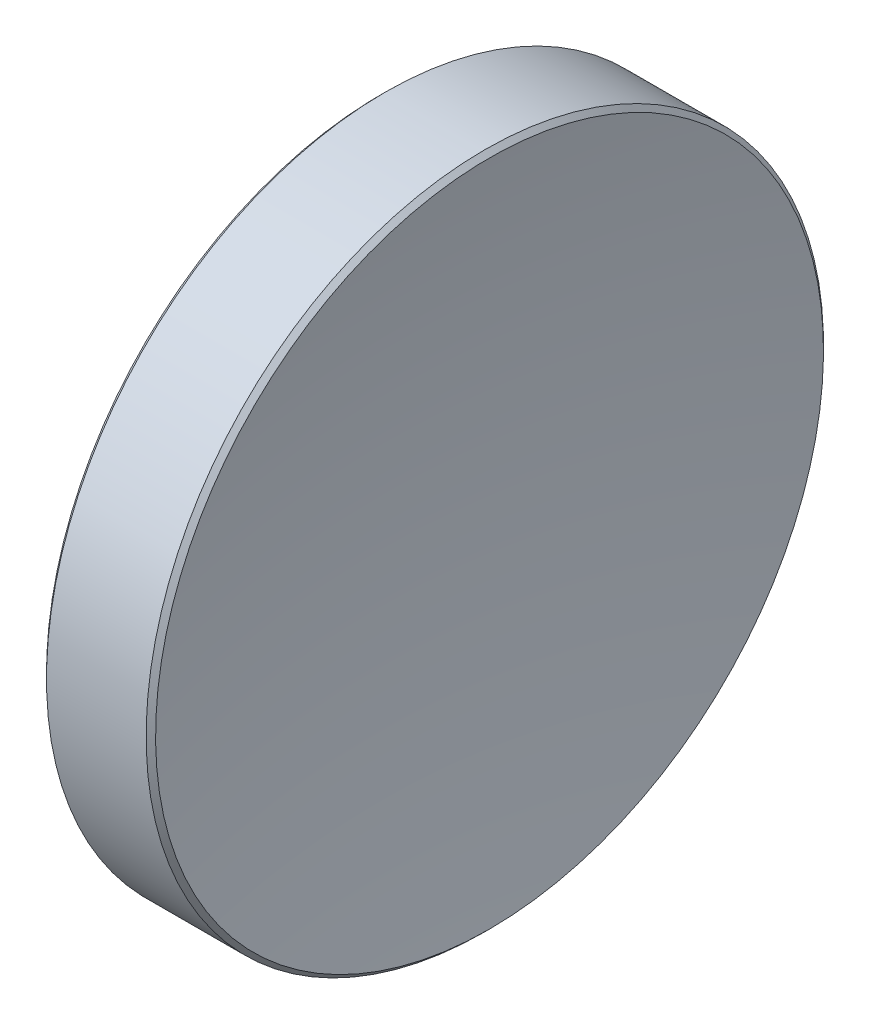
ISO-10303-21;
HEADER;
FILE_DESCRIPTION(('STEP AP214'),'2;1');
FILE_NAME('part.step','',(''),(''),'','','');
FILE_SCHEMA(('AUTOMOTIVE_DESIGN { 1 0 10303 214 1 1 1 1 }'));
ENDSEC;
DATA;
#1=APPLICATION_CONTEXT('core data for automotive mechanical design processes');
#2=APPLICATION_PROTOCOL_DEFINITION('international standard','automotive_design',2000,#1);
#3=PRODUCT_CONTEXT('',#1,'mechanical');
#4=PRODUCT('Part','Part','',(#3));
#5=PRODUCT_RELATED_PRODUCT_CATEGORY('part','',(#4));
#6=PRODUCT_DEFINITION_FORMATION('','',#4);
#7=PRODUCT_DEFINITION_CONTEXT('part definition',#1,'design');
#8=PRODUCT_DEFINITION('design','',#6,#7);
#9=PRODUCT_DEFINITION_SHAPE('','',#8);
#10=(LENGTH_UNIT() NAMED_UNIT(*) SI_UNIT(.MILLI.,.METRE.));
#11=(NAMED_UNIT(*) PLANE_ANGLE_UNIT() SI_UNIT($,.RADIAN.));
#12=(NAMED_UNIT(*) SI_UNIT($,.STERADIAN.) SOLID_ANGLE_UNIT());
#13=UNCERTAINTY_MEASURE_WITH_UNIT(LENGTH_MEASURE(1.E-05),#10,'distance_accuracy_value','');
#14=(GEOMETRIC_REPRESENTATION_CONTEXT(3) GLOBAL_UNCERTAINTY_ASSIGNED_CONTEXT((#13)) GLOBAL_UNIT_ASSIGNED_CONTEXT((#10,
#11,#12)) REPRESENTATION_CONTEXT('',''));
#15=CARTESIAN_POINT('',(0.,0.,0.));
#16=DIRECTION('',(0.,0.,1.));
#17=DIRECTION('',(1.,0.,0.));
#18=AXIS2_PLACEMENT_3D('',#15,#16,#17);
#19=CARTESIAN_POINT('',(148.249977726173,-0.0817444038738536,0.));
#20=DIRECTION('',(0.,0.,-1.));
#21=DIRECTION('',(0.,-1.,0.));
#22=AXIS2_PLACEMENT_3D('',#19,#20,#21);
#23=CIRCLE('',#22,150.);
#24=TRIMMED_CURVE('',#23,(PARAMETER_VALUE(-1.57134128951436)),
(PARAMETER_VALUE(1.57134128951436)),.T.,.PARAMETER.);
#25=CARTESIAN_POINT('',(148.249977726173,0.,0.));
#26=DIRECTION('',(-1.,0.,0.));
#27=AXIS1_PLACEMENT('',#25,#26);
#28=SURFACE_OF_REVOLUTION('',#24,#27);
#29=CARTESIAN_POINT('',(-1.75,0.,0.));
#30=VERTEX_POINT('',#29);
#31=VERTEX_LOOP('',#30);
#32=FACE_BOUND('',#31,.T.);
#33=CARTESIAN_POINT('',(-1.23316380744669,0.,0.));
#34=DIRECTION('',(-1.,0.,0.));
#35=DIRECTION('',(0.,-1.,0.));
#36=AXIS2_PLACEMENT_3D('',#33,#34,#35);
#37=CIRCLE('',#36,12.5232233047034);
#38=CARTESIAN_POINT('',(-1.23316380744669,-12.5232233047034,0.));
#39=VERTEX_POINT('',#38);
#40=EDGE_CURVE('E10',#39,#39,#37,.T.);
#41=ORIENTED_EDGE('',*,*,#40,.T.);
#42=EDGE_LOOP('',(#41));
#43=FACE_BOUND('',#42,.T.);
#44=ADVANCED_FACE('F15',(#32,#43),#28,.T.);
#45=CARTESIAN_POINT('',(-1.05638711215005,0.,0.));
#46=DIRECTION('',(1.,0.,0.));
#47=DIRECTION('',(0.,1.,0.));
#48=AXIS2_PLACEMENT_3D('',#45,#46,#47);
#49=CONICAL_SURFACE('',#48,12.7,0.785398163397456);
#50=ORIENTED_EDGE('',*,*,#40,.F.);
#51=EDGE_LOOP('',(#50));
#52=FACE_BOUND('',#51,.T.);
#53=CARTESIAN_POINT('',(-1.05638711215005,0.,0.));
#54=DIRECTION('',(-1.,0.,0.));
#55=DIRECTION('',(0.,-1.,0.));
#56=AXIS2_PLACEMENT_3D('',#53,#54,#55);
#57=CIRCLE('',#56,12.7);
#58=CARTESIAN_POINT('',(-1.05638711215005,-12.7,0.));
#59=VERTEX_POINT('',#58);
#60=EDGE_CURVE('E21',#59,#59,#57,.T.);
#61=ORIENTED_EDGE('',*,*,#60,.T.);
#62=EDGE_LOOP('',(#61));
#63=FACE_BOUND('',#62,.T.);
#64=ADVANCED_FACE('F26',(#52,#63),#49,.T.);
#65=CARTESIAN_POINT('',(-1.75,0.,0.));
#66=DIRECTION('',(-1.,0.,0.));
#67=DIRECTION('',(0.,-1.,0.));
#68=AXIS2_PLACEMENT_3D('',#65,#66,#67);
#69=CYLINDRICAL_SURFACE('',#68,12.7);
#70=ORIENTED_EDGE('',*,*,#60,.F.);
#71=EDGE_LOOP('',(#70));
#72=FACE_BOUND('',#71,.T.);
#73=CARTESIAN_POINT('',(2.68005949725667,0.,0.));
#74=DIRECTION('',(-1.,0.,0.));
#75=DIRECTION('',(0.,-1.,0.));
#76=AXIS2_PLACEMENT_3D('',#73,#74,#75);
#77=CIRCLE('',#76,12.7);
#78=CARTESIAN_POINT('',(2.68005949725667,-12.7,0.));
#79=VERTEX_POINT('',#78);
#80=EDGE_CURVE('E35',#79,#79,#77,.T.);
#81=ORIENTED_EDGE('',*,*,#80,.T.);
#82=EDGE_LOOP('',(#81));
#83=FACE_BOUND('',#82,.T.);
#84=ADVANCED_FACE('F31',(#72,#83),#69,.T.);
#85=CARTESIAN_POINT('',(2.85683619255331,0.,0.));
#86=DIRECTION('',(-1.,0.,0.));
#87=DIRECTION('',(0.,-1.,0.));
#88=AXIS2_PLACEMENT_3D('',#85,#86,#87);
#89=CONICAL_SURFACE('',#88,12.5232233047034,0.785398163397439);
#90=ORIENTED_EDGE('',*,*,#80,.F.);
#91=EDGE_LOOP('',(#90));
#92=FACE_BOUND('',#91,.T.);
#93=CARTESIAN_POINT('',(2.85683619255331,0.,0.));
#94=DIRECTION('',(-1.,0.,0.));
#95=DIRECTION('',(0.,-1.,0.));
#96=AXIS2_PLACEMENT_3D('',#93,#94,#95);
#97=CIRCLE('',#96,12.5232233047034);
#98=CARTESIAN_POINT('',(2.85683619255331,-12.5232233047034,0.));
#99=VERTEX_POINT('',#98);
#100=EDGE_CURVE('E37',#99,#99,#97,.T.);
#101=ORIENTED_EDGE('',*,*,#100,.T.);
#102=EDGE_LOOP('',(#101));
#103=FACE_BOUND('',#102,.T.);
#104=ADVANCED_FACE('F43',(#92,#103),#89,.T.);
#105=CARTESIAN_POINT('',(73.15,0.,0.));
#106=DIRECTION('',(-1.,0.,0.));
#107=DIRECTION('',(0.,-1.,0.));
#108=AXIS2_PLACEMENT_3D('',#105,#106,#107);
#109=SPHERICAL_SURFACE('',#108,71.4);
#110=ORIENTED_EDGE('',*,*,#100,.F.);
#111=EDGE_LOOP('',(#110));
#112=FACE_BOUND('',#111,.T.);
#113=ADVANCED_FACE('F45',(#112),#109,.F.);
#114=CLOSED_SHELL('',(#44,#64,#84,#104,#113));
#115=MANIFOLD_SOLID_BREP('B1',#114);
#116=ADVANCED_BREP_SHAPE_REPRESENTATION('',(#18,#115),#14);
#117=SHAPE_DEFINITION_REPRESENTATION(#9,#116);
ENDSEC;
END-ISO-10303-21;
